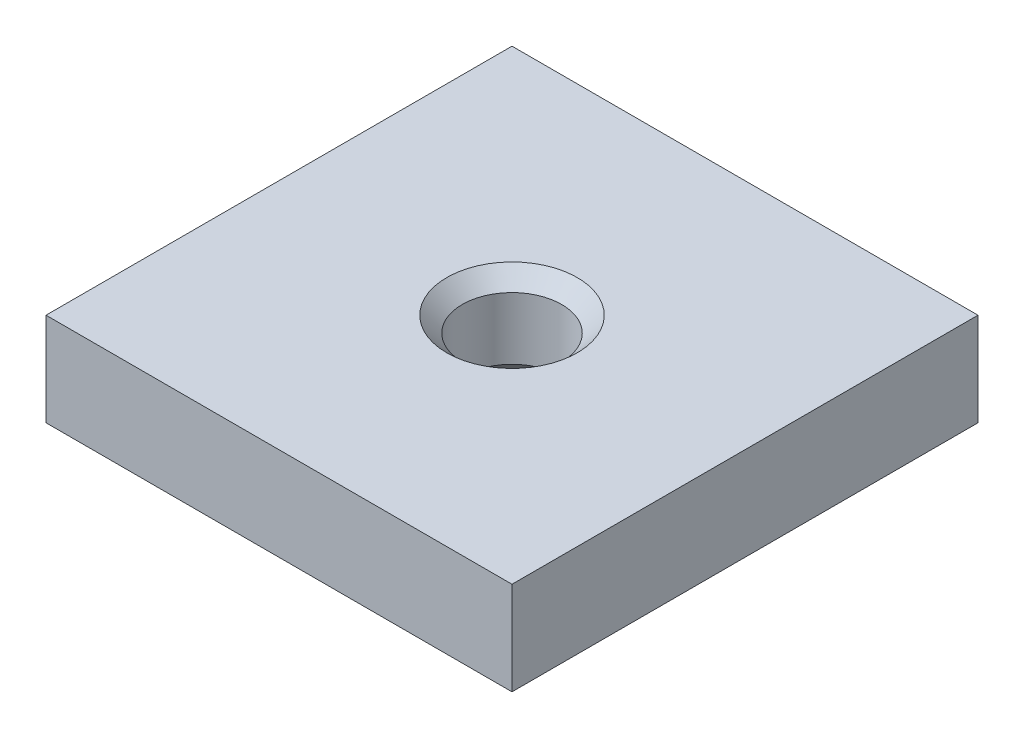
ISO-10303-21;
HEADER;
FILE_DESCRIPTION(('STEP AP214'),'2;1');
FILE_NAME('part.step','',(''),(''),'','','');
FILE_SCHEMA(('AUTOMOTIVE_DESIGN { 1 0 10303 214 1 1 1 1 }'));
ENDSEC;
DATA;
#1=APPLICATION_CONTEXT('core data for automotive mechanical design processes');
#2=APPLICATION_PROTOCOL_DEFINITION('international standard','automotive_design',2000,#1);
#3=PRODUCT_CONTEXT('',#1,'mechanical');
#4=PRODUCT('Part','Part','',(#3));
#5=PRODUCT_RELATED_PRODUCT_CATEGORY('part','',(#4));
#6=PRODUCT_DEFINITION_FORMATION('','',#4);
#7=PRODUCT_DEFINITION_CONTEXT('part definition',#1,'design');
#8=PRODUCT_DEFINITION('design','',#6,#7);
#9=PRODUCT_DEFINITION_SHAPE('','',#8);
#10=(LENGTH_UNIT() NAMED_UNIT(*) SI_UNIT(.MILLI.,.METRE.));
#11=(NAMED_UNIT(*) PLANE_ANGLE_UNIT() SI_UNIT($,.RADIAN.));
#12=(NAMED_UNIT(*) SI_UNIT($,.STERADIAN.) SOLID_ANGLE_UNIT());
#13=UNCERTAINTY_MEASURE_WITH_UNIT(LENGTH_MEASURE(1.E-05),#10,'distance_accuracy_value','');
#14=(GEOMETRIC_REPRESENTATION_CONTEXT(3) GLOBAL_UNCERTAINTY_ASSIGNED_CONTEXT((#13)) GLOBAL_UNIT_ASSIGNED_CONTEXT((#10,
#11,#12)) REPRESENTATION_CONTEXT('',''));
#15=CARTESIAN_POINT('',(0.,0.,0.));
#16=DIRECTION('',(0.,0.,1.));
#17=DIRECTION('',(1.,0.,0.));
#18=AXIS2_PLACEMENT_3D('',#15,#16,#17);
#19=CARTESIAN_POINT('',(-7.5,1.5,-7.5));
#20=DIRECTION('',(1.,0.,0.));
#21=DIRECTION('',(0.,0.,-1.));
#22=AXIS2_PLACEMENT_3D('',#19,#20,#21);
#23=PLANE('',#22);
#24=DIRECTION('',(0.,0.,1.));
#25=VECTOR('',#24,1.);
#26=CARTESIAN_POINT('',(-7.5,-1.5,-7.5));
#27=LINE('',#26,#25);
#28=CARTESIAN_POINT('',(-7.5,-1.5,-7.5));
#29=VERTEX_POINT('',#28);
#30=CARTESIAN_POINT('',(-7.5,-1.5,7.5));
#31=VERTEX_POINT('',#30);
#32=EDGE_CURVE('E84',#29,#31,#27,.T.);
#33=ORIENTED_EDGE('',*,*,#32,.T.);
#34=DIRECTION('',(0.,-1.,0.));
#35=VECTOR('',#34,1.);
#36=CARTESIAN_POINT('',(-7.5,1.5,7.5));
#37=LINE('',#36,#35);
#38=CARTESIAN_POINT('',(-7.5,1.5,7.5));
#39=VERTEX_POINT('',#38);
#40=EDGE_CURVE('E75',#39,#31,#37,.T.);
#41=ORIENTED_EDGE('',*,*,#40,.F.);
#42=DIRECTION('',(0.,0.,1.));
#43=VECTOR('',#42,1.);
#44=CARTESIAN_POINT('',(-7.5,1.5,-7.5));
#45=LINE('',#44,#43);
#46=CARTESIAN_POINT('',(-7.5,1.5,-7.5));
#47=VERTEX_POINT('',#46);
#48=EDGE_CURVE('E69',#47,#39,#45,.T.);
#49=ORIENTED_EDGE('',*,*,#48,.F.);
#50=DIRECTION('',(0.,-1.,0.));
#51=VECTOR('',#50,1.);
#52=CARTESIAN_POINT('',(-7.5,1.5,-7.5));
#53=LINE('',#52,#51);
#54=EDGE_CURVE('E80',#47,#29,#53,.T.);
#55=ORIENTED_EDGE('',*,*,#54,.T.);
#56=EDGE_LOOP('',(#33,#41,#49,#55));
#57=FACE_BOUND('',#56,.T.);
#58=ADVANCED_FACE('F16',(#57),#23,.F.);
#59=CARTESIAN_POINT('',(-7.5,1.5,7.5));
#60=DIRECTION('',(0.,0.,-1.));
#61=DIRECTION('',(-1.,0.,0.));
#62=AXIS2_PLACEMENT_3D('',#59,#60,#61);
#63=PLANE('',#62);
#64=DIRECTION('',(1.,0.,0.));
#65=VECTOR('',#64,1.);
#66=CARTESIAN_POINT('',(-7.5,-1.5,7.5));
#67=LINE('',#66,#65);
#68=CARTESIAN_POINT('',(7.5,-1.5,7.5));
#69=VERTEX_POINT('',#68);
#70=EDGE_CURVE('E74',#31,#69,#67,.T.);
#71=ORIENTED_EDGE('',*,*,#70,.T.);
#72=DIRECTION('',(0.,-1.,0.));
#73=VECTOR('',#72,1.);
#74=CARTESIAN_POINT('',(7.5,1.5,7.5));
#75=LINE('',#74,#73);
#76=CARTESIAN_POINT('',(7.5,1.5,7.5));
#77=VERTEX_POINT('',#76);
#78=EDGE_CURVE('E72',#77,#69,#75,.T.);
#79=ORIENTED_EDGE('',*,*,#78,.F.);
#80=DIRECTION('',(1.,0.,0.));
#81=VECTOR('',#80,1.);
#82=CARTESIAN_POINT('',(-7.5,1.5,7.5));
#83=LINE('',#82,#81);
#84=EDGE_CURVE('E64',#39,#77,#83,.T.);
#85=ORIENTED_EDGE('',*,*,#84,.F.);
#86=ORIENTED_EDGE('',*,*,#40,.T.);
#87=EDGE_LOOP('',(#71,#79,#85,#86));
#88=FACE_BOUND('',#87,.T.);
#89=ADVANCED_FACE('F73',(#88),#63,.F.);
#90=CARTESIAN_POINT('',(7.5,1.5,-7.5));
#91=DIRECTION('',(-1.,0.,0.));
#92=DIRECTION('',(0.,0.,1.));
#93=AXIS2_PLACEMENT_3D('',#90,#91,#92);
#94=PLANE('',#93);
#95=DIRECTION('',(0.,0.,-1.));
#96=VECTOR('',#95,1.);
#97=CARTESIAN_POINT('',(7.5,-1.5,-7.5));
#98=LINE('',#97,#96);
#99=CARTESIAN_POINT('',(7.5,-1.5,-7.5));
#100=VERTEX_POINT('',#99);
#101=EDGE_CURVE('E50',#69,#100,#98,.T.);
#102=ORIENTED_EDGE('',*,*,#101,.T.);
#103=DIRECTION('',(0.,-1.,0.));
#104=VECTOR('',#103,1.);
#105=CARTESIAN_POINT('',(7.5,1.5,-7.5));
#106=LINE('',#105,#104);
#107=CARTESIAN_POINT('',(7.5,1.5,-7.5));
#108=VERTEX_POINT('',#107);
#109=EDGE_CURVE('E76',#108,#100,#106,.T.);
#110=ORIENTED_EDGE('',*,*,#109,.F.);
#111=DIRECTION('',(0.,0.,-1.));
#112=VECTOR('',#111,1.);
#113=CARTESIAN_POINT('',(7.5,1.5,-7.5));
#114=LINE('',#113,#112);
#115=EDGE_CURVE('E67',#77,#108,#114,.T.);
#116=ORIENTED_EDGE('',*,*,#115,.F.);
#117=ORIENTED_EDGE('',*,*,#78,.T.);
#118=EDGE_LOOP('',(#102,#110,#116,#117));
#119=FACE_BOUND('',#118,.T.);
#120=ADVANCED_FACE('F78',(#119),#94,.F.);
#121=CARTESIAN_POINT('',(-7.5,1.5,-7.5));
#122=DIRECTION('',(0.,0.,1.));
#123=DIRECTION('',(1.,0.,0.));
#124=AXIS2_PLACEMENT_3D('',#121,#122,#123);
#125=PLANE('',#124);
#126=DIRECTION('',(-1.,0.,0.));
#127=VECTOR('',#126,1.);
#128=CARTESIAN_POINT('',(-7.5,-1.5,-7.5));
#129=LINE('',#128,#127);
#130=EDGE_CURVE('E56',#100,#29,#129,.T.);
#131=ORIENTED_EDGE('',*,*,#130,.T.);
#132=ORIENTED_EDGE('',*,*,#54,.F.);
#133=DIRECTION('',(-1.,0.,0.));
#134=VECTOR('',#133,1.);
#135=CARTESIAN_POINT('',(-7.5,1.5,-7.5));
#136=LINE('',#135,#134);
#137=EDGE_CURVE('E33',#108,#47,#136,.T.);
#138=ORIENTED_EDGE('',*,*,#137,.F.);
#139=ORIENTED_EDGE('',*,*,#109,.T.);
#140=EDGE_LOOP('',(#131,#132,#138,#139));
#141=FACE_BOUND('',#140,.T.);
#142=ADVANCED_FACE('F115',(#141),#125,.F.);
#143=CARTESIAN_POINT('',(0.,1.5,0.));
#144=DIRECTION('',(0.,1.,0.));
#145=DIRECTION('',(0.,0.,1.));
#146=AXIS2_PLACEMENT_3D('',#143,#144,#145);
#147=PLANE('',#146);
#148=CARTESIAN_POINT('',(0.,1.5,0.));
#149=DIRECTION('',(0.,1.,0.));
#150=DIRECTION('',(0.,0.,1.));
#151=AXIS2_PLACEMENT_3D('',#148,#149,#150);
#152=CIRCLE('',#151,2.1);
#153=CARTESIAN_POINT('',(0.,1.5,2.1));
#154=VERTEX_POINT('',#153);
#155=EDGE_CURVE('E10',#154,#154,#152,.F.);
#156=ORIENTED_EDGE('',*,*,#155,.T.);
#157=EDGE_LOOP('',(#156));
#158=FACE_BOUND('',#157,.T.);
#159=ORIENTED_EDGE('',*,*,#48,.T.);
#160=ORIENTED_EDGE('',*,*,#84,.T.);
#161=ORIENTED_EDGE('',*,*,#115,.T.);
#162=ORIENTED_EDGE('',*,*,#137,.T.);
#163=EDGE_LOOP('',(#159,#160,#161,#162));
#164=FACE_BOUND('',#163,.T.);
#165=ADVANCED_FACE('F65',(#158,#164),#147,.T.);
#166=CARTESIAN_POINT('',(0.,-1.5,0.));
#167=DIRECTION('',(0.,1.,0.));
#168=DIRECTION('',(0.,0.,1.));
#169=AXIS2_PLACEMENT_3D('',#166,#167,#168);
#170=PLANE('',#169);
#171=CARTESIAN_POINT('',(0.,-1.5,0.));
#172=DIRECTION('',(0.,1.,0.));
#173=DIRECTION('',(0.,0.,1.));
#174=AXIS2_PLACEMENT_3D('',#171,#172,#173);
#175=CIRCLE('',#174,2.10000000000001);
#176=CARTESIAN_POINT('',(0.,-1.5,2.10000000000001));
#177=VERTEX_POINT('',#176);
#178=EDGE_CURVE('E93',#177,#177,#175,.T.);
#179=ORIENTED_EDGE('',*,*,#178,.T.);
#180=EDGE_LOOP('',(#179));
#181=FACE_BOUND('',#180,.T.);
#182=ORIENTED_EDGE('',*,*,#32,.F.);
#183=ORIENTED_EDGE('',*,*,#130,.F.);
#184=ORIENTED_EDGE('',*,*,#101,.F.);
#185=ORIENTED_EDGE('',*,*,#70,.F.);
#186=EDGE_LOOP('',(#182,#183,#184,#185));
#187=FACE_BOUND('',#186,.T.);
#188=ADVANCED_FACE('F109',(#181,#187),#170,.F.);
#189=CARTESIAN_POINT('',(0.,-1.5,0.));
#190=DIRECTION('',(0.,1.,0.));
#191=DIRECTION('',(0.,0.,1.));
#192=AXIS2_PLACEMENT_3D('',#189,#190,#191);
#193=CYLINDRICAL_SURFACE('',#192,1.6);
#194=CARTESIAN_POINT('',(0.,-0.999999999999994,0.));
#195=DIRECTION('',(0.,1.,0.));
#196=DIRECTION('',(0.,0.,1.));
#197=AXIS2_PLACEMENT_3D('',#194,#195,#196);
#198=CIRCLE('',#197,1.6);
#199=CARTESIAN_POINT('',(0.,-0.999999999999994,1.6));
#200=VERTEX_POINT('',#199);
#201=EDGE_CURVE('E25',#200,#200,#198,.F.);
#202=ORIENTED_EDGE('',*,*,#201,.T.);
#203=EDGE_LOOP('',(#202));
#204=FACE_BOUND('',#203,.T.);
#205=CARTESIAN_POINT('',(0.,1.,0.));
#206=DIRECTION('',(0.,1.,0.));
#207=DIRECTION('',(0.,0.,1.));
#208=AXIS2_PLACEMENT_3D('',#205,#206,#207);
#209=CIRCLE('',#208,1.6);
#210=CARTESIAN_POINT('',(0.,1.,1.6));
#211=VERTEX_POINT('',#210);
#212=EDGE_CURVE('E96',#211,#211,#209,.T.);
#213=ORIENTED_EDGE('',*,*,#212,.T.);
#214=EDGE_LOOP('',(#213));
#215=FACE_BOUND('',#214,.T.);
#216=ADVANCED_FACE('F101',(#204,#215),#193,.F.);
#217=CARTESIAN_POINT('',(0.,-1.5,0.));
#218=DIRECTION('',(0.,-1.,0.));
#219=DIRECTION('',(0.,0.,-1.));
#220=AXIS2_PLACEMENT_3D('',#217,#218,#219);
#221=CONICAL_SURFACE('',#220,2.10000000000001,0.785398163397449);
#222=ORIENTED_EDGE('',*,*,#201,.F.);
#223=EDGE_LOOP('',(#222));
#224=FACE_BOUND('',#223,.T.);
#225=ORIENTED_EDGE('',*,*,#178,.F.);
#226=EDGE_LOOP('',(#225));
#227=FACE_BOUND('',#226,.T.);
#228=ADVANCED_FACE('F104',(#224,#227),#221,.F.);
#229=CARTESIAN_POINT('',(0.,1.,0.));
#230=DIRECTION('',(0.,1.,0.));
#231=DIRECTION('',(0.,0.,1.));
#232=AXIS2_PLACEMENT_3D('',#229,#230,#231);
#233=CONICAL_SURFACE('',#232,1.6,0.78539816339745);
#234=ORIENTED_EDGE('',*,*,#155,.F.);
#235=EDGE_LOOP('',(#234));
#236=FACE_BOUND('',#235,.T.);
#237=ORIENTED_EDGE('',*,*,#212,.F.);
#238=EDGE_LOOP('',(#237));
#239=FACE_BOUND('',#238,.T.);
#240=ADVANCED_FACE('F18',(#236,#239),#233,.F.);
#241=CLOSED_SHELL('',(#58,#89,#120,#142,#165,#188,#216,#228,#240));
#242=MANIFOLD_SOLID_BREP('B1',#241);
#243=ADVANCED_BREP_SHAPE_REPRESENTATION('',(#18,#242),#14);
#244=SHAPE_DEFINITION_REPRESENTATION(#9,#243);
ENDSEC;
END-ISO-10303-21;
